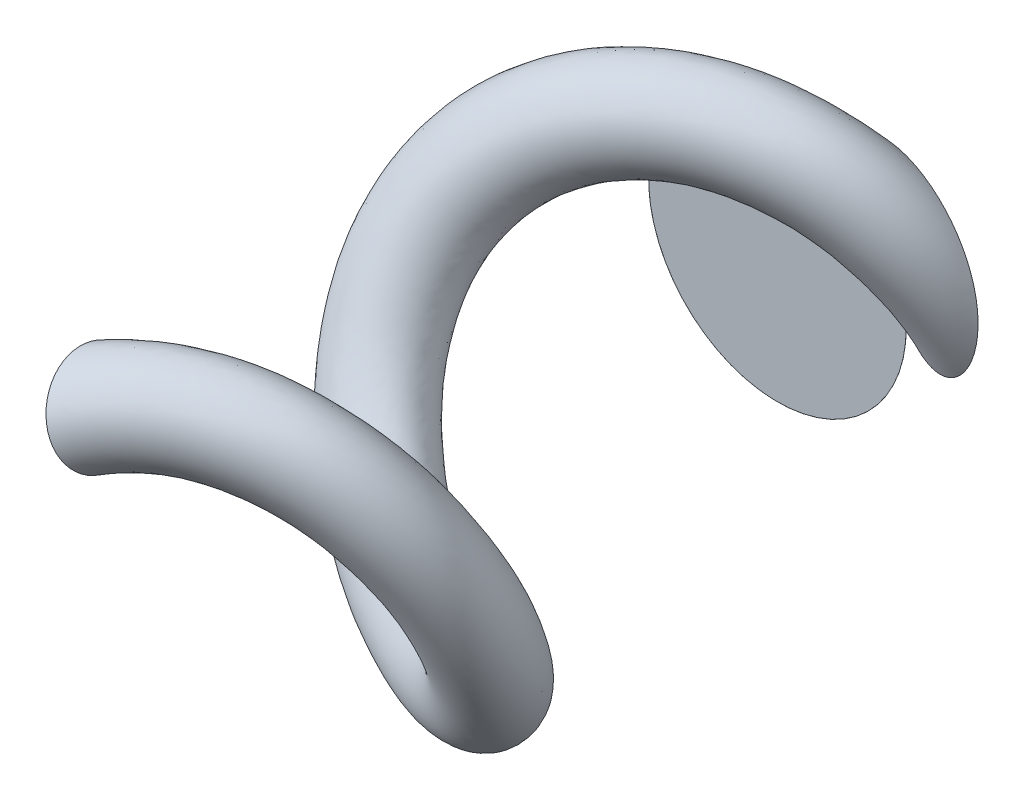
ISO-10303-21;
HEADER;
FILE_DESCRIPTION(('STEP AP214'),'2;1');
FILE_NAME('part.step','',(''),(''),'','','');
FILE_SCHEMA(('AUTOMOTIVE_DESIGN { 1 0 10303 214 1 1 1 1 }'));
ENDSEC;
DATA;
#1=APPLICATION_CONTEXT('core data for automotive mechanical design processes');
#2=APPLICATION_PROTOCOL_DEFINITION('international standard','automotive_design',2000,#1);
#3=PRODUCT_CONTEXT('',#1,'mechanical');
#4=PRODUCT('Part','Part','',(#3));
#5=PRODUCT_RELATED_PRODUCT_CATEGORY('part','',(#4));
#6=PRODUCT_DEFINITION_FORMATION('','',#4);
#7=PRODUCT_DEFINITION_CONTEXT('part definition',#1,'design');
#8=PRODUCT_DEFINITION('design','',#6,#7);
#9=PRODUCT_DEFINITION_SHAPE('','',#8);
#10=(LENGTH_UNIT() NAMED_UNIT(*) SI_UNIT(.MILLI.,.METRE.));
#11=(NAMED_UNIT(*) PLANE_ANGLE_UNIT() SI_UNIT($,.RADIAN.));
#12=(NAMED_UNIT(*) SI_UNIT($,.STERADIAN.) SOLID_ANGLE_UNIT());
#13=UNCERTAINTY_MEASURE_WITH_UNIT(LENGTH_MEASURE(1.E-05),#10,'distance_accuracy_value','');
#14=(GEOMETRIC_REPRESENTATION_CONTEXT(3) GLOBAL_UNCERTAINTY_ASSIGNED_CONTEXT((#13)) GLOBAL_UNIT_ASSIGNED_CONTEXT((#10,
#11,#12)) REPRESENTATION_CONTEXT('',''));
#15=CARTESIAN_POINT('',(0.,0.,0.));
#16=DIRECTION('',(0.,0.,1.));
#17=DIRECTION('',(1.,0.,0.));
#18=AXIS2_PLACEMENT_3D('',#15,#16,#17);
#19=CARTESIAN_POINT('',(1.0524500900317E-08,-0.635,-0.190500020678217));
#20=CARTESIAN_POINT('',(0.10057572484828,-0.634999998333056,-0.139244926436731));
#21=CARTESIAN_POINT('',(0.196228760536334,-0.603919923117605,-0.0904984350644574));
#22=CARTESIAN_POINT('',(0.392454238504707,-0.54016133385198,0.00950156493554266));
#23=CARTESIAN_POINT('',(0.513727626433159,-0.373241109524866,0.109501564935543));
#24=CARTESIAN_POINT('',(0.635001014361611,-0.206320885197752,0.209501564935543));
#25=CARTESIAN_POINT('',(0.634999999992326,3.1219076503704E-06,0.309501564935543));
#26=CARTESIAN_POINT('',(0.63499898562304,0.206327129013052,0.409501564935543));
#27=CARTESIAN_POINT('',(0.513723956410607,0.373246160877554,0.509501564935543));
#28=CARTESIAN_POINT('',(0.392448927198174,0.540165192742055,0.609501564935543));
#29=CARTESIAN_POINT('',(0.196222822315106,0.603921852562643,0.709501564935543));
#30=CARTESIAN_POINT('',(-3.28256796188404E-06,0.667678512383231,0.809501564935543));
#31=CARTESIAN_POINT('',(-0.196228760536334,0.603919923117605,0.909501564935543));
#32=CARTESIAN_POINT('',(-0.392454238504707,0.54016133385198,1.00950156493554));
#33=CARTESIAN_POINT('',(-0.513727626433159,0.373241109524866,1.10950156493554));
#34=CARTESIAN_POINT('',(-0.635001014361611,0.206320885197752,1.20950156493554));
#35=CARTESIAN_POINT('',(-0.634999999992326,-3.12190765044817E-06,1.30950156493554));
#36=CARTESIAN_POINT('',(-0.63499898562304,-0.206327129013052,1.40950156493554));
#37=CARTESIAN_POINT('',(-0.513723956410607,-0.373246160877554,1.50950156493554));
#38=CARTESIAN_POINT('',(-0.392448927198174,-0.540165192742055,1.60950156493554));
#39=CARTESIAN_POINT('',(-0.196222822315106,-0.603921852562643,1.70950156493554));
#40=CARTESIAN_POINT('',(3.28256796196581E-06,-0.667678512383231,1.80950156493554));
#41=CARTESIAN_POINT('',(0.196228760536334,-0.603919923117605,1.90950156493554));
#42=CARTESIAN_POINT('',(0.392454238504707,-0.54016133385198,2.00950156493554));
#43=CARTESIAN_POINT('',(0.513727626433159,-0.373241109524866,2.10950156493554));
#44=CARTESIAN_POINT('',(0.635001014361611,-0.206320885197752,2.20950156493554));
#45=CARTESIAN_POINT('',(0.634999999992326,3.1219076503704E-06,2.30950156493554));
#46=CARTESIAN_POINT('',(0.63499898562304,0.206327129013052,2.40950156493554));
#47=CARTESIAN_POINT('',(0.513723956410607,0.373246160877554,2.50950156493554));
#48=CARTESIAN_POINT('',(0.392448927198174,0.540165192742055,2.60950156493554));
#49=CARTESIAN_POINT('',(0.196222822315106,0.603921852562643,2.70950156493554));
#50=CARTESIAN_POINT('',(-3.28256796188404E-06,0.667678512383231,2.80950156493554));
#51=CARTESIAN_POINT('',(-0.196228760536334,0.603919923117605,2.90950156493554));
#52=CARTESIAN_POINT('',(-0.206828337201754,0.600475854273961,2.91490329807191));
#53=CARTESIAN_POINT('',(-0.217300527016805,0.596661948642796,2.92036329486514));
#54=CARTESIAN_POINT('',(4.20980036498917E-09,-0.254,-0.190500020678217));
#55=CARTESIAN_POINT('',(0.0402302899393119,-0.253999999333223,-0.139244926436731));
#56=CARTESIAN_POINT('',(0.0784915042145338,-0.241567969247042,-0.0904984350644574));
#57=CARTESIAN_POINT('',(0.156981695401883,-0.216064533540792,0.00950156493554266));
#58=CARTESIAN_POINT('',(0.205491050573264,-0.149296443809946,0.109501564935543));
#59=CARTESIAN_POINT('',(0.254000405744645,-0.0825283540791007,0.209501564935543));
#60=CARTESIAN_POINT('',(0.25399999999693,1.24876306014816E-06,0.309501564935543));
#61=CARTESIAN_POINT('',(0.253999594249216,0.0825308516052209,0.409501564935543));
#62=CARTESIAN_POINT('',(0.205489582564243,0.149298464351021,0.509501564935543));
#63=CARTESIAN_POINT('',(0.15697957087927,0.216066077096822,0.609501564935543));
#64=CARTESIAN_POINT('',(0.0784891289260424,0.241568741025057,0.709501564935543));
#65=CARTESIAN_POINT('',(-1.31302718475362E-06,0.267071404953292,0.809501564935543));
#66=CARTESIAN_POINT('',(-0.0784915042145337,0.241567969247042,0.909501564935543));
#67=CARTESIAN_POINT('',(-0.156981695401883,0.216064533540792,1.00950156493554));
#68=CARTESIAN_POINT('',(-0.205491050573264,0.149296443809946,1.10950156493554));
#69=CARTESIAN_POINT('',(-0.254000405744645,0.0825283540791007,1.20950156493554));
#70=CARTESIAN_POINT('',(-0.25399999999693,-1.24876306017927E-06,1.30950156493554));
#71=CARTESIAN_POINT('',(-0.253999594249216,-0.082530851605221,1.40950156493554));
#72=CARTESIAN_POINT('',(-0.205489582564243,-0.149298464351022,1.50950156493554));
#73=CARTESIAN_POINT('',(-0.15697957087927,-0.216066077096822,1.60950156493554));
#74=CARTESIAN_POINT('',(-0.0784891289260424,-0.241568741025057,1.70950156493554));
#75=CARTESIAN_POINT('',(1.31302718478632E-06,-0.267071404953292,1.80950156493554));
#76=CARTESIAN_POINT('',(0.0784915042145338,-0.241567969247042,1.90950156493554));
#77=CARTESIAN_POINT('',(0.156981695401883,-0.216064533540792,2.00950156493554));
#78=CARTESIAN_POINT('',(0.205491050573264,-0.149296443809946,2.10950156493554));
#79=CARTESIAN_POINT('',(0.254000405744645,-0.0825283540791007,2.20950156493554));
#80=CARTESIAN_POINT('',(0.25399999999693,1.24876306014816E-06,2.30950156493554));
#81=CARTESIAN_POINT('',(0.253999594249216,0.0825308516052209,2.40950156493554));
#82=CARTESIAN_POINT('',(0.205489582564243,0.149298464351021,2.50950156493554));
#83=CARTESIAN_POINT('',(0.15697957087927,0.216066077096822,2.60950156493554));
#84=CARTESIAN_POINT('',(0.0784891289260424,0.241568741025057,2.70950156493554));
#85=CARTESIAN_POINT('',(-1.31302718475362E-06,0.267071404953292,2.80950156493554));
#86=CARTESIAN_POINT('',(-0.0784915042145337,0.241567969247042,2.90950156493554));
#87=CARTESIAN_POINT('',(-0.0827313348807018,0.240190341709584,2.91490329807191));
#88=CARTESIAN_POINT('',(-0.086920210806722,0.238664779457118,2.92036329486514));
#89=CARTESIAN_POINT('',(4.20980036498917E-09,-0.254,0.190499979321783));
#90=CARTESIAN_POINT('',(0.0402302899393119,-0.253999999333223,0.241755073563269));
#91=CARTESIAN_POINT('',(0.0784915042145338,-0.241567969247042,0.290501564935543));
#92=CARTESIAN_POINT('',(0.156981695401883,-0.216064533540792,0.390501564935543));
#93=CARTESIAN_POINT('',(0.205491050573264,-0.149296443809946,0.490501564935543));
#94=CARTESIAN_POINT('',(0.254000405744645,-0.0825283540791007,0.590501564935543));
#95=CARTESIAN_POINT('',(0.25399999999693,1.24876306014816E-06,0.690501564935543));
#96=CARTESIAN_POINT('',(0.253999594249216,0.0825308516052209,0.790501564935543));
#97=CARTESIAN_POINT('',(0.205489582564243,0.149298464351021,0.890501564935543));
#98=CARTESIAN_POINT('',(0.15697957087927,0.216066077096822,0.990501564935543));
#99=CARTESIAN_POINT('',(0.0784891289260424,0.241568741025057,1.09050156493554));
#100=CARTESIAN_POINT('',(-1.31302718475362E-06,0.267071404953292,1.19050156493554));
#101=CARTESIAN_POINT('',(-0.0784915042145337,0.241567969247042,1.29050156493554));
#102=CARTESIAN_POINT('',(-0.156981695401883,0.216064533540792,1.39050156493554));
#103=CARTESIAN_POINT('',(-0.205491050573264,0.149296443809946,1.49050156493554));
#104=CARTESIAN_POINT('',(-0.254000405744645,0.0825283540791007,1.59050156493554));
#105=CARTESIAN_POINT('',(-0.25399999999693,-1.24876306017927E-06,1.69050156493554));
#106=CARTESIAN_POINT('',(-0.253999594249216,-0.082530851605221,1.79050156493554));
#107=CARTESIAN_POINT('',(-0.205489582564243,-0.149298464351022,1.89050156493554));
#108=CARTESIAN_POINT('',(-0.15697957087927,-0.216066077096822,1.99050156493554));
#109=CARTESIAN_POINT('',(-0.0784891289260424,-0.241568741025057,2.09050156493554));
#110=CARTESIAN_POINT('',(1.31302718478632E-06,-0.267071404953292,2.19050156493554));
#111=CARTESIAN_POINT('',(0.0784915042145338,-0.241567969247042,2.29050156493554));
#112=CARTESIAN_POINT('',(0.156981695401883,-0.216064533540792,2.39050156493554));
#113=CARTESIAN_POINT('',(0.205491050573264,-0.149296443809946,2.49050156493554));
#114=CARTESIAN_POINT('',(0.254000405744645,-0.0825283540791007,2.59050156493554));
#115=CARTESIAN_POINT('',(0.25399999999693,1.24876306014816E-06,2.69050156493554));
#116=CARTESIAN_POINT('',(0.253999594249216,0.0825308516052209,2.79050156493554));
#117=CARTESIAN_POINT('',(0.205489582564243,0.149298464351021,2.89050156493554));
#118=CARTESIAN_POINT('',(0.15697957087927,0.216066077096822,2.99050156493554));
#119=CARTESIAN_POINT('',(0.0784891289260424,0.241568741025057,3.09050156493554));
#120=CARTESIAN_POINT('',(-1.31302718475362E-06,0.267071404953292,3.19050156493554));
#121=CARTESIAN_POINT('',(-0.0784915042145337,0.241567969247042,3.29050156493554));
#122=CARTESIAN_POINT('',(-0.0827313348807018,0.240190341709584,3.29590329807191));
#123=CARTESIAN_POINT('',(-0.086920210806722,0.238664779457118,3.30136329486514));
#124=CARTESIAN_POINT('',(1.0524500900317E-08,-0.635,0.190499979321783));
#125=CARTESIAN_POINT('',(0.10057572484828,-0.634999998333056,0.241755073563269));
#126=CARTESIAN_POINT('',(0.196228760536334,-0.603919923117605,0.290501564935543));
#127=CARTESIAN_POINT('',(0.392454238504707,-0.54016133385198,0.390501564935543));
#128=CARTESIAN_POINT('',(0.513727626433159,-0.373241109524866,0.490501564935543));
#129=CARTESIAN_POINT('',(0.635001014361611,-0.206320885197752,0.590501564935543));
#130=CARTESIAN_POINT('',(0.634999999992326,3.1219076503704E-06,0.690501564935543));
#131=CARTESIAN_POINT('',(0.63499898562304,0.206327129013052,0.790501564935543));
#132=CARTESIAN_POINT('',(0.513723956410607,0.373246160877554,0.890501564935543));
#133=CARTESIAN_POINT('',(0.392448927198174,0.540165192742055,0.990501564935543));
#134=CARTESIAN_POINT('',(0.196222822315106,0.603921852562643,1.09050156493554));
#135=CARTESIAN_POINT('',(-3.28256796188404E-06,0.667678512383231,1.19050156493554));
#136=CARTESIAN_POINT('',(-0.196228760536334,0.603919923117605,1.29050156493554));
#137=CARTESIAN_POINT('',(-0.392454238504707,0.54016133385198,1.39050156493554));
#138=CARTESIAN_POINT('',(-0.513727626433159,0.373241109524866,1.49050156493554));
#139=CARTESIAN_POINT('',(-0.635001014361611,0.206320885197752,1.59050156493554));
#140=CARTESIAN_POINT('',(-0.634999999992326,-3.12190765044817E-06,1.69050156493554));
#141=CARTESIAN_POINT('',(-0.63499898562304,-0.206327129013052,1.79050156493554));
#142=CARTESIAN_POINT('',(-0.513723956410607,-0.373246160877554,1.89050156493554));
#143=CARTESIAN_POINT('',(-0.392448927198174,-0.540165192742055,1.99050156493554));
#144=CARTESIAN_POINT('',(-0.196222822315106,-0.603921852562643,2.09050156493554));
#145=CARTESIAN_POINT('',(3.28256796196581E-06,-0.667678512383231,2.19050156493554));
#146=CARTESIAN_POINT('',(0.196228760536334,-0.603919923117605,2.29050156493554));
#147=CARTESIAN_POINT('',(0.392454238504707,-0.54016133385198,2.39050156493554));
#148=CARTESIAN_POINT('',(0.513727626433159,-0.373241109524866,2.49050156493554));
#149=CARTESIAN_POINT('',(0.635001014361611,-0.206320885197752,2.59050156493554));
#150=CARTESIAN_POINT('',(0.634999999992326,3.1219076503704E-06,2.69050156493554));
#151=CARTESIAN_POINT('',(0.63499898562304,0.206327129013052,2.79050156493554));
#152=CARTESIAN_POINT('',(0.513723956410607,0.373246160877554,2.89050156493554));
#153=CARTESIAN_POINT('',(0.392448927198174,0.540165192742055,2.99050156493554));
#154=CARTESIAN_POINT('',(0.196222822315106,0.603921852562643,3.09050156493554));
#155=CARTESIAN_POINT('',(-3.28256796188404E-06,0.667678512383231,3.19050156493554));
#156=CARTESIAN_POINT('',(-0.196228760536334,0.603919923117605,3.29050156493554));
#157=CARTESIAN_POINT('',(-0.206828337201754,0.600475854273961,3.29590329807191));
#158=CARTESIAN_POINT('',(-0.217300527016805,0.596661948642796,3.30136329486514));
#159=CARTESIAN_POINT('',(1.68392014599567E-08,-1.016,0.190499979321783));
#160=CARTESIAN_POINT('',(0.160921159757248,-1.01599999733289,0.241755073563269));
#161=CARTESIAN_POINT('',(0.313966016858135,-0.966271876988168,0.290501564935543));
#162=CARTESIAN_POINT('',(0.627926781607531,-0.864258134163167,0.390501564935543));
#163=CARTESIAN_POINT('',(0.821964202293054,-0.597185775239785,0.490501564935543));
#164=CARTESIAN_POINT('',(1.01600162297858,-0.330113416316403,0.590501564935543));
#165=CARTESIAN_POINT('',(1.01599999998772,4.99505224059264E-06,0.690501564935543));
#166=CARTESIAN_POINT('',(1.01599837699686,0.330123406420884,0.790501564935543));
#167=CARTESIAN_POINT('',(0.821958330256971,0.597193857404086,0.890501564935543));
#168=CARTESIAN_POINT('',(0.627918283517078,0.864264308387288,0.990501564935543));
#169=CARTESIAN_POINT('',(0.31395651570417,0.966274964100228,1.09050156493554));
#170=CARTESIAN_POINT('',(-5.25210873901447E-06,1.06828561981317,1.19050156493554));
#171=CARTESIAN_POINT('',(-0.313966016858135,0.966271876988168,1.29050156493554));
#172=CARTESIAN_POINT('',(-0.627926781607531,0.864258134163167,1.39050156493554));
#173=CARTESIAN_POINT('',(-0.821964202293054,0.597185775239785,1.49050156493554));
#174=CARTESIAN_POINT('',(-1.01600162297858,0.330113416316403,1.59050156493554));
#175=CARTESIAN_POINT('',(-1.01599999998772,-4.99505224071707E-06,1.69050156493554));
#176=CARTESIAN_POINT('',(-1.01599837699686,-0.330123406420884,1.79050156493554));
#177=CARTESIAN_POINT('',(-0.821958330256971,-0.597193857404086,1.89050156493554));
#178=CARTESIAN_POINT('',(-0.627918283517078,-0.864264308387288,1.99050156493554));
#179=CARTESIAN_POINT('',(-0.313956515704169,-0.966274964100228,2.09050156493554));
#180=CARTESIAN_POINT('',(5.2521087391453E-06,-1.06828561981317,2.19050156493554));
#181=CARTESIAN_POINT('',(0.313966016858135,-0.966271876988168,2.29050156493554));
#182=CARTESIAN_POINT('',(0.627926781607531,-0.864258134163167,2.39050156493554));
#183=CARTESIAN_POINT('',(0.821964202293054,-0.597185775239785,2.49050156493554));
#184=CARTESIAN_POINT('',(1.01600162297858,-0.330113416316403,2.59050156493554));
#185=CARTESIAN_POINT('',(1.01599999998772,4.99505224059264E-06,2.69050156493554));
#186=CARTESIAN_POINT('',(1.01599837699686,0.330123406420884,2.79050156493554));
#187=CARTESIAN_POINT('',(0.821958330256971,0.597193857404086,2.89050156493554));
#188=CARTESIAN_POINT('',(0.627918283517078,0.864264308387288,2.99050156493554));
#189=CARTESIAN_POINT('',(0.31395651570417,0.966274964100228,3.09050156493554));
#190=CARTESIAN_POINT('',(-5.25210873901447E-06,1.06828561981317,3.19050156493554));
#191=CARTESIAN_POINT('',(-0.313966016858135,0.966271876988168,3.29050156493554));
#192=CARTESIAN_POINT('',(-0.330925339522807,0.960761366838337,3.29590329807191));
#193=CARTESIAN_POINT('',(-0.347680843226888,0.954659117828474,3.30136329486514));
#194=CARTESIAN_POINT('',(1.68392014599567E-08,-1.016,-0.190500020678217));
#195=CARTESIAN_POINT('',(0.160921159757248,-1.01599999733289,-0.139244926436731));
#196=CARTESIAN_POINT('',(0.313966016858135,-0.966271876988168,-0.0904984350644574));
#197=CARTESIAN_POINT('',(0.627926781607531,-0.864258134163167,0.00950156493554266));
#198=CARTESIAN_POINT('',(0.821964202293054,-0.597185775239785,0.109501564935543));
#199=CARTESIAN_POINT('',(1.01600162297858,-0.330113416316403,0.209501564935543));
#200=CARTESIAN_POINT('',(1.01599999998772,4.99505224059264E-06,0.309501564935543));
#201=CARTESIAN_POINT('',(1.01599837699686,0.330123406420884,0.409501564935543));
#202=CARTESIAN_POINT('',(0.821958330256971,0.597193857404086,0.509501564935543));
#203=CARTESIAN_POINT('',(0.627918283517078,0.864264308387288,0.609501564935543));
#204=CARTESIAN_POINT('',(0.31395651570417,0.966274964100228,0.709501564935543));
#205=CARTESIAN_POINT('',(-5.25210873901447E-06,1.06828561981317,0.809501564935543));
#206=CARTESIAN_POINT('',(-0.313966016858135,0.966271876988168,0.909501564935543));
#207=CARTESIAN_POINT('',(-0.627926781607531,0.864258134163167,1.00950156493554));
#208=CARTESIAN_POINT('',(-0.821964202293054,0.597185775239785,1.10950156493554));
#209=CARTESIAN_POINT('',(-1.01600162297858,0.330113416316403,1.20950156493554));
#210=CARTESIAN_POINT('',(-1.01599999998772,-4.99505224071707E-06,1.30950156493554));
#211=CARTESIAN_POINT('',(-1.01599837699686,-0.330123406420884,1.40950156493554));
#212=CARTESIAN_POINT('',(-0.821958330256971,-0.597193857404086,1.50950156493554));
#213=CARTESIAN_POINT('',(-0.627918283517078,-0.864264308387288,1.60950156493554));
#214=CARTESIAN_POINT('',(-0.313956515704169,-0.966274964100228,1.70950156493554));
#215=CARTESIAN_POINT('',(5.2521087391453E-06,-1.06828561981317,1.80950156493554));
#216=CARTESIAN_POINT('',(0.313966016858135,-0.966271876988168,1.90950156493554));
#217=CARTESIAN_POINT('',(0.627926781607531,-0.864258134163167,2.00950156493554));
#218=CARTESIAN_POINT('',(0.821964202293054,-0.597185775239785,2.10950156493554));
#219=CARTESIAN_POINT('',(1.01600162297858,-0.330113416316403,2.20950156493554));
#220=CARTESIAN_POINT('',(1.01599999998772,4.99505224059264E-06,2.30950156493554));
#221=CARTESIAN_POINT('',(1.01599837699686,0.330123406420884,2.40950156493554));
#222=CARTESIAN_POINT('',(0.821958330256971,0.597193857404086,2.50950156493554));
#223=CARTESIAN_POINT('',(0.627918283517078,0.864264308387288,2.60950156493554));
#224=CARTESIAN_POINT('',(0.31395651570417,0.966274964100228,2.70950156493554));
#225=CARTESIAN_POINT('',(-5.25210873901447E-06,1.06828561981317,2.80950156493554));
#226=CARTESIAN_POINT('',(-0.313966016858135,0.966271876988168,2.90950156493554));
#227=CARTESIAN_POINT('',(-0.330925339522807,0.960761366838337,2.91490329807191));
#228=CARTESIAN_POINT('',(-0.347680843226888,0.954659117828474,2.92036329486514));
#229=CARTESIAN_POINT('',(1.0524500900317E-08,-0.635,-0.190500020678217));
#230=CARTESIAN_POINT('',(0.10057572484828,-0.634999998333056,-0.139244926436731));
#231=CARTESIAN_POINT('',(0.196228760536334,-0.603919923117605,-0.0904984350644574));
#232=CARTESIAN_POINT('',(0.392454238504707,-0.54016133385198,0.00950156493554266));
#233=CARTESIAN_POINT('',(0.513727626433159,-0.373241109524866,0.109501564935543));
#234=CARTESIAN_POINT('',(0.635001014361611,-0.206320885197752,0.209501564935543));
#235=CARTESIAN_POINT('',(0.634999999992326,3.1219076503704E-06,0.309501564935543));
#236=CARTESIAN_POINT('',(0.63499898562304,0.206327129013052,0.409501564935543));
#237=CARTESIAN_POINT('',(0.513723956410607,0.373246160877554,0.509501564935543));
#238=CARTESIAN_POINT('',(0.392448927198174,0.540165192742055,0.609501564935543));
#239=CARTESIAN_POINT('',(0.196222822315106,0.603921852562643,0.709501564935543));
#240=CARTESIAN_POINT('',(-3.28256796188404E-06,0.667678512383231,0.809501564935543));
#241=CARTESIAN_POINT('',(-0.196228760536334,0.603919923117605,0.909501564935543));
#242=CARTESIAN_POINT('',(-0.392454238504707,0.54016133385198,1.00950156493554));
#243=CARTESIAN_POINT('',(-0.513727626433159,0.373241109524866,1.10950156493554));
#244=CARTESIAN_POINT('',(-0.635001014361611,0.206320885197752,1.20950156493554));
#245=CARTESIAN_POINT('',(-0.634999999992326,-3.12190765044817E-06,1.30950156493554));
#246=CARTESIAN_POINT('',(-0.63499898562304,-0.206327129013052,1.40950156493554));
#247=CARTESIAN_POINT('',(-0.513723956410607,-0.373246160877554,1.50950156493554));
#248=CARTESIAN_POINT('',(-0.392448927198174,-0.540165192742055,1.60950156493554));
#249=CARTESIAN_POINT('',(-0.196222822315106,-0.603921852562643,1.70950156493554));
#250=CARTESIAN_POINT('',(3.28256796196581E-06,-0.667678512383231,1.80950156493554));
#251=CARTESIAN_POINT('',(0.196228760536334,-0.603919923117605,1.90950156493554));
#252=CARTESIAN_POINT('',(0.392454238504707,-0.54016133385198,2.00950156493554));
#253=CARTESIAN_POINT('',(0.513727626433159,-0.373241109524866,2.10950156493554));
#254=CARTESIAN_POINT('',(0.635001014361611,-0.206320885197752,2.20950156493554));
#255=CARTESIAN_POINT('',(0.634999999992326,3.1219076503704E-06,2.30950156493554));
#256=CARTESIAN_POINT('',(0.63499898562304,0.206327129013052,2.40950156493554));
#257=CARTESIAN_POINT('',(0.513723956410607,0.373246160877554,2.50950156493554));
#258=CARTESIAN_POINT('',(0.392448927198174,0.540165192742055,2.60950156493554));
#259=CARTESIAN_POINT('',(0.196222822315106,0.603921852562643,2.70950156493554));
#260=CARTESIAN_POINT('',(-3.28256796188404E-06,0.667678512383231,2.80950156493554));
#261=CARTESIAN_POINT('',(-0.196228760536334,0.603919923117605,2.90950156493554));
#262=CARTESIAN_POINT('',(-0.206828337201754,0.600475854273961,2.91490329807191));
#263=CARTESIAN_POINT('',(-0.217300527016805,0.596661948642796,2.92036329486514));
#264=(BOUNDED_SURFACE() B_SPLINE_SURFACE(3,2,((#19,#20,#21,#22,#23,#24,#25,#26,#27,#28,#29,#30,
#31,#32,#33,#34,#35,#36,#37,#38,#39,#40,#41,#42,#43,#44,#45,#46,#47,#48,#49,#50,#51,#52,#53),
(#54,#55,#56,#57,#58,#59,#60,#61,#62,#63,#64,#65,#66,#67,#68,#69,#70,#71,#72,#73,#74,#75,#76,
#77,#78,#79,#80,#81,#82,#83,#84,#85,#86,#87,#88),(#89,#90,#91,#92,#93,#94,#95,#96,#97,#98,#99,
#100,#101,#102,#103,#104,#105,#106,#107,#108,#109,#110,#111,#112,#113,#114,#115,#116,#117,#118,
#119,#120,#121,#122,#123),(#124,#125,#126,#127,#128,#129,#130,#131,#132,#133,#134,#135,#136,
#137,#138,#139,#140,#141,#142,#143,#144,#145,#146,#147,#148,#149,#150,#151,#152,#153,#154,#155,
#156,#157,#158),(#159,#160,#161,#162,#163,#164,#165,#166,#167,#168,#169,#170,#171,#172,#173,
#174,#175,#176,#177,#178,#179,#180,#181,#182,#183,#184,#185,#186,#187,#188,#189,#190,#191,#192,
#193),(#194,#195,#196,#197,#198,#199,#200,#201,#202,#203,#204,#205,#206,#207,#208,#209,#210,
#211,#212,#213,#214,#215,#216,#217,#218,#219,#220,#221,#222,#223,#224,#225,#226,#227,#228),
(#229,#230,#231,#232,#233,#234,#235,#236,#237,#238,#239,#240,#241,#242,#243,#244,#245,#246,#247,
#248,#249,#250,#251,#252,#253,#254,#255,#256,#257,#258,#259,#260,#261,#262,#263)),.UNSPECIFIED.,
.T.,.F.,.F.) B_SPLINE_SURFACE_WITH_KNOTS((4,3,4),(3,2,2,2,2,2,2,2,2,2,2,2,2,2,2,2,2,3),(0.,0.5,
1.),(0.124999613297243,0.15,0.2,0.25,0.3,0.35,0.4,0.45,0.5,0.55,0.6,0.65,0.7,0.75,0.8,0.85,0.9,
0.902831986665305),
.UNSPECIFIED.) GEOMETRIC_REPRESENTATION_ITEM() RATIONAL_B_SPLINE_SURFACE(((0.975528258153432,
0.975527879615975,1.,0.951056516295154,1.,0.951056516295154,1.,0.951056516295154,1.,
0.951056516295154,1.,0.951056516295154,1.,0.951056516295154,1.,0.951056516295154,1.,
0.951056516295154,1.,0.951056516295154,1.,0.951056516295154,1.,0.951056516295154,1.,
0.951056516295154,1.,0.951056516295154,1.,0.951056516295154,1.,0.951056516295154,1.,
0.997227854135886,0.994769735476631),(0.325176086051144,0.325175959871992,0.333333333333333,
0.317018838765051,0.333333333333333,0.317018838765051,0.333333333333333,0.317018838765051,
0.333333333333333,0.317018838765051,0.333333333333333,0.317018838765051,0.333333333333333,
0.317018838765051,0.333333333333333,0.317018838765051,0.333333333333333,0.317018838765051,
0.333333333333333,0.317018838765051,0.333333333333333,0.317018838765051,0.333333333333333,
0.317018838765051,0.333333333333333,0.317018838765051,0.333333333333333,0.317018838765051,
0.333333333333333,0.317018838765051,0.333333333333333,0.317018838765051,0.333333333333333,
0.332409284711962,0.331589911825544),(0.325176086051144,0.325175959871992,0.333333333333333,
0.317018838765051,0.333333333333333,0.317018838765051,0.333333333333333,0.317018838765051,
0.333333333333333,0.317018838765051,0.333333333333333,0.317018838765051,0.333333333333333,
0.317018838765051,0.333333333333333,0.317018838765051,0.333333333333333,0.317018838765051,
0.333333333333333,0.317018838765051,0.333333333333333,0.317018838765051,0.333333333333333,
0.317018838765051,0.333333333333333,0.317018838765051,0.333333333333333,0.317018838765051,
0.333333333333333,0.317018838765051,0.333333333333333,0.317018838765051,0.333333333333333,
0.332409284711962,0.331589911825544),(0.975528258153432,0.975527879615975,1.,0.951056516295154,
1.,0.951056516295154,1.,0.951056516295154,1.,0.951056516295154,1.,0.951056516295154,1.,
0.951056516295154,1.,0.951056516295154,1.,0.951056516295154,1.,0.951056516295154,1.,
0.951056516295154,1.,0.951056516295154,1.,0.951056516295154,1.,0.951056516295154,1.,
0.951056516295154,1.,0.951056516295154,1.,0.997227854135886,0.994769735476631),
(0.325176086051144,0.325175959871992,0.333333333333333,0.317018838765051,0.333333333333333,
0.317018838765051,0.333333333333333,0.317018838765051,0.333333333333333,0.317018838765051,
0.333333333333333,0.317018838765051,0.333333333333333,0.317018838765051,0.333333333333333,
0.317018838765051,0.333333333333333,0.317018838765051,0.333333333333333,0.317018838765051,
0.333333333333333,0.317018838765051,0.333333333333333,0.317018838765051,0.333333333333333,
0.317018838765051,0.333333333333333,0.317018838765051,0.333333333333333,0.317018838765051,
0.333333333333333,0.317018838765051,0.333333333333333,0.332409284711962,0.331589911825544),
(0.325176086051144,0.325175959871992,0.333333333333333,0.317018838765051,0.333333333333333,
0.317018838765051,0.333333333333333,0.317018838765051,0.333333333333333,0.317018838765051,
0.333333333333333,0.317018838765051,0.333333333333333,0.317018838765051,0.333333333333333,
0.317018838765051,0.333333333333333,0.317018838765051,0.333333333333333,0.317018838765051,
0.333333333333333,0.317018838765051,0.333333333333333,0.317018838765051,0.333333333333333,
0.317018838765051,0.333333333333333,0.317018838765051,0.333333333333333,0.317018838765051,
0.333333333333333,0.317018838765051,0.333333333333333,0.332409284711962,0.331589911825544),
(0.975528258153432,0.975527879615975,1.,0.951056516295154,1.,0.951056516295154,1.,
0.951056516295154,1.,0.951056516295154,1.,0.951056516295154,1.,0.951056516295154,1.,
0.951056516295154,1.,0.951056516295154,1.,0.951056516295154,1.,0.951056516295154,1.,
0.951056516295154,1.,0.951056516295154,1.,0.951056516295154,1.,0.951056516295154,1.,
0.951056516295154,1.,0.997227854135886,0.994769735476631))) REPRESENTATION_ITEM('') SURFACE());
#265=CARTESIAN_POINT('',(-0.217300527016805,0.596661948642796,3.11086329486514));
#266=DIRECTION('',(0.939625115972908,0.342205554357173,0.));
#267=DIRECTION('',(0.,0.,-1.));
#268=AXIS2_PLACEMENT_3D('',#265,#266,#267);
#269=CIRCLE('',#268,0.1905);
#270=CARTESIAN_POINT('',(-0.217300527016805,0.596661948642796,2.92036329486514));
#271=VERTEX_POINT('',#270);
#272=EDGE_CURVE('E11',#271,#271,#269,.T.);
#273=CARTESIAN_POINT('',(0.315104809459201,0.551302057909891,0.644725767358515));
#274=CARTESIAN_POINT('',(0.311884678444055,0.545665014820833,0.644725767358507));
#275=CARTESIAN_POINT('',(0.30923236313631,0.539689964232537,0.644725767358517));
#276=CARTESIAN_POINT('',(0.30501694294037,0.527359606900084,0.644725767358528));
#277=CARTESIAN_POINT('',(0.303458724488678,0.521002730180117,0.644725767358529));
#278=CARTESIAN_POINT('',(0.300741149281939,0.505079483383155,0.644725767358514));
#279=CARTESIAN_POINT('',(0.300123698804782,0.495424191055044,0.644725767358489));
#280=CARTESIAN_POINT('',(0.300295809570544,0.476116682865371,0.644725767358556));
#281=CARTESIAN_POINT('',(0.301091976944641,0.466464693391492,0.644725767358649));
#282=CARTESIAN_POINT('',(0.304334235316176,0.442061083612529,0.644725767358621));
#283=CARTESIAN_POINT('',(0.307444005092883,0.427403668013147,0.644725767358358));
#284=CARTESIAN_POINT('',(0.314960602845898,0.398469866003485,0.644725767358688));
#285=CARTESIAN_POINT('',(0.319366415539858,0.384193190844489,0.64472576735928));
#286=CARTESIAN_POINT('',(0.329039281482271,0.355825992320998,0.64472576735776));
#287=CARTESIAN_POINT('',(0.33431218176806,0.341737488136398,0.644725767355628));
#288=CARTESIAN_POINT('',(0.345420617536347,0.313790678537277,0.644725767361417));
#289=CARTESIAN_POINT('',(0.351256057189138,0.299932334384408,0.644725767369337));
#290=CARTESIAN_POINT('',(0.361470845549355,0.276633809966116,0.644725767366475));
#291=CARTESIAN_POINT('',(0.365745294850556,0.267147112401115,0.644725767360701));
#292=CARTESIAN_POINT('',(0.374365737832359,0.248206377997642,0.644725767356345));
#293=CARTESIAN_POINT('',(0.378711732884788,0.238752341789637,0.644725767357763));
#294=CARTESIAN_POINT('',(0.391911541979714,0.210463173234548,0.644725767360042));
#295=CARTESIAN_POINT('',(0.400926670425201,0.191702141113795,0.644725767358929));
#296=CARTESIAN_POINT('',(0.419542373890379,0.154585191500943,0.644725767358119));
#297=CARTESIAN_POINT('',(0.429139898946938,0.13622775101047,0.644725767358416));
#298=CARTESIAN_POINT('',(0.448994382137404,0.0998775463239507,0.644725767358629));
#299=CARTESIAN_POINT('',(0.459251185883778,0.0818846980376879,0.644725767358545));
#300=CARTESIAN_POINT('',(0.476943957543171,0.0523045157499519,0.644725767358508));
#301=CARTESIAN_POINT('',(0.484171906047638,0.0405932736670102,0.64472576735852));
#302=CARTESIAN_POINT('',(0.495369476469507,0.0232273970311225,0.644725767358524));
#303=CARTESIAN_POINT('',(0.499167951032782,0.0174627627728296,0.644725767358523));
#304=CARTESIAN_POINT('',(0.506895032678722,0.00602173236552011,0.644725767358522));
#305=CARTESIAN_POINT('',(0.510823640899782,0.000345336989045269,0.644725767358521));
#306=CARTESIAN_POINT('',(0.523041129209302,-0.0165529716891448,0.64472576735852));
#307=CARTESIAN_POINT('',(0.531689896380917,-0.0275251518821005,0.644725767358521));
#308=CARTESIAN_POINT('',(0.55035602293629,-0.0481774701457851,0.644725767358524));
#309=CARTESIAN_POINT('',(0.560365608551265,-0.0578643704431847,0.644725767358526));
#310=CARTESIAN_POINT('',(0.581282583769626,-0.0739182149765468,0.644725767358519));
#311=CARTESIAN_POINT('',(0.59198671122459,-0.0805263694746308,0.644725767358512));
#312=CARTESIAN_POINT('',(0.60929530280591,-0.0877116533159939,0.644725767358517));
#313=CARTESIAN_POINT('',(0.615320814993253,-0.089656088124307,0.644725767358521));
#314=CARTESIAN_POINT('',(0.627631817296484,-0.0923623908994267,0.644725767358524));
#315=CARTESIAN_POINT('',(0.633916819901972,-0.0931263813012232,0.644725767358522));
#316=CARTESIAN_POINT('',(0.645892887246436,-0.093338167065181,0.644725767358522));
#317=CARTESIAN_POINT('',(0.65158188764973,-0.092907445681794,0.644725767358522));
#318=CARTESIAN_POINT('',(0.662790384499232,-0.0910184368830428,0.644725767358523));
#319=CARTESIAN_POINT('',(0.668309636083685,-0.0895587316252412,0.644725767358523));
#320=CARTESIAN_POINT('',(0.683599188941532,-0.0840910054245316,0.644725767358523));
#321=CARTESIAN_POINT('',(0.692972489640347,-0.0789712869715288,0.644725767358523));
#322=CARTESIAN_POINT('',(0.715510556039162,-0.0628680531467876,0.644725767358522));
#323=CARTESIAN_POINT('',(0.727426136222271,-0.0502168060005345,0.644725767358522));
#324=CARTESIAN_POINT('',(0.745329842203382,-0.0255761862947882,0.644725767358522));
#325=CARTESIAN_POINT('',(0.75204619797082,-0.0140601781140895,0.644725767358523));
#326=CARTESIAN_POINT('',(0.763690569575606,0.00986548101940318,0.644725767358522));
#327=CARTESIAN_POINT('',(0.768614280211354,0.0222771986369696,0.644725767358521));
#328=CARTESIAN_POINT('',(0.78567513105894,0.0741229172814229,0.644725767358522));
#329=CARTESIAN_POINT('',(0.791336139179828,0.115734260227601,0.644725767358537));
#330=CARTESIAN_POINT('',(0.790827587926677,0.199970517491258,0.644725767358507));
#331=CARTESIAN_POINT('',(0.784248283305657,0.242581647281752,0.64472576735846));
#332=CARTESIAN_POINT('',(0.765056272616089,0.308360080205133,0.644725767358561));
#333=CARTESIAN_POINT('',(0.755840506665702,0.332575440797191,0.644725767358639));
#334=CARTESIAN_POINT('',(0.733748621745658,0.379350510232921,0.644725767358406));
#335=CARTESIAN_POINT('',(0.720866168494353,0.401907268203767,0.644725767358094));
#336=CARTESIAN_POINT('',(0.698472376282037,0.434905616301296,0.644725767358268));
#337=CARTESIAN_POINT('',(0.69012715783086,0.446156424397765,0.644725767358453));
#338=CARTESIAN_POINT('',(0.672531971221359,0.467926329498634,0.644725767358592));
#339=CARTESIAN_POINT('',(0.663281829438666,0.47844528542009,0.644725767358546));
#340=CARTESIAN_POINT('',(0.634202041779195,0.508676052255667,0.644725767358475));
#341=CARTESIAN_POINT('',(0.612997740218589,0.52712960563741,0.644725767358516));
#342=CARTESIAN_POINT('',(0.575678952145391,0.553415806587813,0.644725767358527));
#343=CARTESIAN_POINT('',(0.560545787320316,0.562662701850509,0.644725767358517));
#344=CARTESIAN_POINT('',(0.529089188987213,0.578820931020872,0.644725767358528));
#345=CARTESIAN_POINT('',(0.512768688243545,0.585737796968396,0.644725767358548));
#346=CARTESIAN_POINT('',(0.484456102969893,0.594871690995114,0.644725767358535));
#347=CARTESIAN_POINT('',(0.472722864719015,0.597883006573227,0.644725767358517));
#348=CARTESIAN_POINT('',(0.448959373063211,0.602175704834888,0.644725767358528));
#349=CARTESIAN_POINT('',(0.436929584243332,0.60345963760248,0.644725767358558));
#350=CARTESIAN_POINT('',(0.408555148892697,0.603916565545612,0.644725767358576));
#351=CARTESIAN_POINT('',(0.392158875415481,0.602204605217663,0.644725767358547));
#352=CARTESIAN_POINT('',(0.364717391292804,0.594116895898698,0.644725767358526));
#353=CARTESIAN_POINT('',(0.35334951812245,0.58899499490316,0.644725767358527));
#354=CARTESIAN_POINT('',(0.338186238498173,0.578458085280182,0.644725767358523));
#355=CARTESIAN_POINT('',(0.33342101656105,0.574433127982923,0.64472576735852));
#356=CARTESIAN_POINT('',(0.324797089296296,0.565516953631949,0.644725767358525));
#357=CARTESIAN_POINT('',(0.320935716030719,0.560628362734039,0.644725767358531));
#358=CARTESIAN_POINT('',(0.316732325040875,0.554069654059569,0.64472576735852));
#359=CARTESIAN_POINT('',(0.315901201860188,0.552696193197879,0.644725767358517));
#360=CARTESIAN_POINT('',(0.315104809459201,0.551302057909891,0.644725767358515));
#361=B_SPLINE_CURVE_WITH_KNOTS('',3,(#273,#274,#275,#276,#277,#278,#279,#280,#281,#282,#283,
#284,#285,#286,#287,#288,#289,#290,#291,#292,#293,#294,#295,#296,#297,#298,#299,#300,#301,#302,
#303,#304,#305,#306,#307,#308,#309,#310,#311,#312,#313,#314,#315,#316,#317,#318,#319,#320,#321,
#322,#323,#324,#325,#326,#327,#328,#329,#330,#331,#332,#333,#334,#335,#336,#337,#338,#339,#340,
#341,#342,#343,#344,#345,#346,#347,#348,#349,#350,#351,#352,#353,#354,#355,#356,#357,#358,#359,
#360),.UNSPECIFIED.,.T.,.F.,(4,2,2,2,2,2,2,2,2,2,2,2,2,2,2,2,2,2,2,2,2,2,2,2,2,2,2,2,2,2,2,2,2,
2,2,2,2,2,2,2,2,2,2,4),(0.,0.0194718945006883,0.0390302101876145,0.0678878181879751,
0.096880638966378,0.141709882649453,0.186504101503304,0.231613798494926,0.276715824493466,
0.307930597679447,0.339145970079957,0.401580515706048,0.463712393998908,0.525829775107829,
0.567108282400494,0.587817175994011,0.60852625079435,0.650360090587808,0.691964276240058,
0.729218953795668,0.748115976147656,0.766978982016529,0.783996105501363,0.80103672292226,
0.832636999475914,0.883816516981883,0.923667323325266,0.963613213393551,1.08718013794563,
1.2149580670048,1.29240931949887,1.36999519135579,1.41197489458492,1.45396266816419,
1.53769649158706,1.59075365235134,1.64368394010534,1.67991547688824,1.7160934672198,
1.76479945980618,1.80149764309917,1.82009897735389,1.8386446924573,1.84346041850703),.UNSPECIFIED.);
#362=CARTESIAN_POINT('',(0.31521376897294,0.398377057383959,0.644725767358523));
#363=VERTEX_POINT('',#362);
#364=CARTESIAN_POINT('',(0.507979992833947,0.00450853417681712,0.644725767358523));
#365=VERTEX_POINT('',#364);
#366=EDGE_CURVE('E38',#363,#365,#361,.T.);
#367=EDGE_CURVE('E66',#365,#363,#361,.T.);
#368=ORIENTED_EDGE('',*,*,#272,.T.);
#369=EDGE_LOOP('',(#368));
#370=FACE_BOUND('',#369,.T.);
#371=ORIENTED_EDGE('',*,*,#366,.T.);
#372=ORIENTED_EDGE('',*,*,#367,.T.);
#373=EDGE_LOOP('',(#371,#372));
#374=FACE_BOUND('',#373,.T.);
#375=ADVANCED_FACE('F33',(#370,#374),#264,.T.);
#376=CARTESIAN_POINT('',(-0.217300527016805,0.596661948642796,3.30136329486514));
#377=DIRECTION('',(0.939625115972908,0.342205554357173,0.));
#378=DIRECTION('',(-0.342205554357173,0.939625115972908,0.));
#379=AXIS2_PLACEMENT_3D('',#376,#377,#378);
#380=PLANE('',#379);
#381=ORIENTED_EDGE('',*,*,#272,.F.);
#382=EDGE_LOOP('',(#381));
#383=FACE_BOUND('',#382,.T.);
#384=ADVANCED_FACE('F35',(#383),#380,.F.);
#385=CARTESIAN_POINT('',(-1.38302295820836,2.54,0.644725767358523));
#386=DIRECTION('',(0.,0.,-1.));
#387=DIRECTION('',(-1.,0.,0.));
#388=AXIS2_PLACEMENT_3D('',#385,#386,#387);
#389=PLANE('',#388);
#390=ORIENTED_EDGE('',*,*,#367,.F.);
#391=CARTESIAN_POINT('',(0.,0.,0.644725767358523));
#392=DIRECTION('',(0.,0.,-1.));
#393=DIRECTION('',(-1.,0.,0.));
#394=AXIS2_PLACEMENT_3D('',#391,#392,#393);
#395=CIRCLE('',#394,0.508);
#396=EDGE_CURVE('E59',#363,#365,#395,.T.);
#397=ORIENTED_EDGE('',*,*,#396,.F.);
#398=EDGE_LOOP('',(#390,#397));
#399=FACE_BOUND('',#398,.T.);
#400=ADVANCED_FACE('F67',(#399),#389,.T.);
#401=CARTESIAN_POINT('',(0.,0.,0.644471767358523));
#402=DIRECTION('',(0.,0.,1.));
#403=DIRECTION('',(1.,0.,0.));
#404=AXIS2_PLACEMENT_3D('',#401,#402,#403);
#405=CYLINDRICAL_SURFACE('',#404,0.508);
#406=CARTESIAN_POINT('',(0.,0.,0.644471767358523));
#407=DIRECTION('',(0.,0.,-1.));
#408=DIRECTION('',(-1.,0.,0.));
#409=AXIS2_PLACEMENT_3D('',#406,#407,#408);
#410=CIRCLE('',#409,0.508);
#411=CARTESIAN_POINT('',(-0.508,0.,0.644471767358523));
#412=VERTEX_POINT('',#411);
#413=EDGE_CURVE('E65',#412,#412,#410,.T.);
#414=ORIENTED_EDGE('',*,*,#413,.F.);
#415=EDGE_LOOP('',(#414));
#416=FACE_BOUND('',#415,.T.);
#417=ORIENTED_EDGE('',*,*,#396,.T.);
#418=EDGE_CURVE('E53',#365,#363,#395,.T.);
#419=ORIENTED_EDGE('',*,*,#418,.T.);
#420=EDGE_LOOP('',(#417,#419));
#421=FACE_BOUND('',#420,.T.);
#422=ADVANCED_FACE('F62',(#416,#421),#405,.T.);
#423=CARTESIAN_POINT('',(0.,0.,0.644471767358523));
#424=DIRECTION('',(0.,0.,-1.));
#425=DIRECTION('',(-1.,0.,0.));
#426=AXIS2_PLACEMENT_3D('',#423,#424,#425);
#427=PLANE('',#426);
#428=ORIENTED_EDGE('',*,*,#413,.T.);
#429=EDGE_LOOP('',(#428));
#430=FACE_BOUND('',#429,.T.);
#431=ADVANCED_FACE('F111',(#430),#427,.T.);
#432=CARTESIAN_POINT('',(0.,0.,0.644725767358523));
#433=DIRECTION('',(0.,0.,-1.));
#434=DIRECTION('',(-1.,0.,0.));
#435=AXIS2_PLACEMENT_3D('',#432,#433,#434);
#436=PLANE('',#435);
#437=ORIENTED_EDGE('',*,*,#366,.F.);
#438=ORIENTED_EDGE('',*,*,#418,.F.);
#439=EDGE_LOOP('',(#437,#438));
#440=FACE_BOUND('',#439,.T.);
#441=ADVANCED_FACE('F56',(#440),#436,.F.);
#442=CLOSED_SHELL('',(#375,#384,#400,#422,#431,#441));
#443=MANIFOLD_SOLID_BREP('B2',#442);
#444=ADVANCED_BREP_SHAPE_REPRESENTATION('',(#18,#443),#14);
#445=SHAPE_DEFINITION_REPRESENTATION(#9,#444);
ENDSEC;
END-ISO-10303-21;
